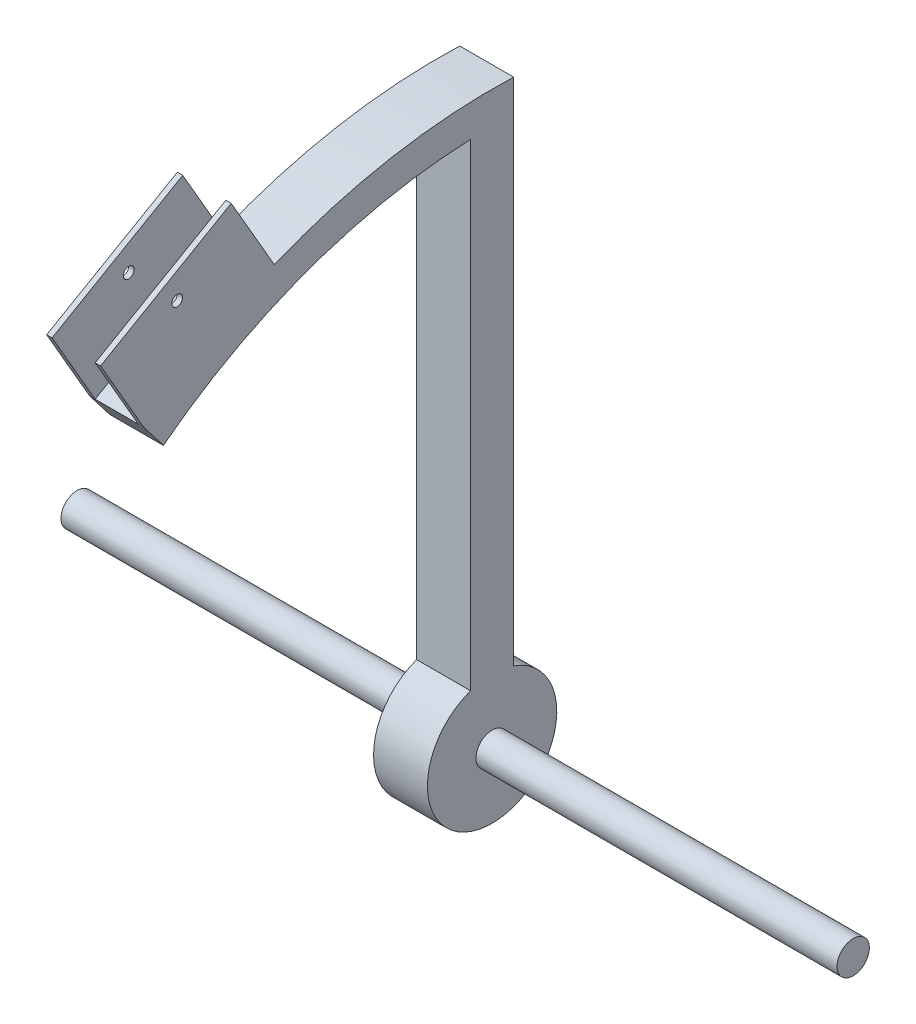
ISO-10303-21;
HEADER;
FILE_DESCRIPTION(('STEP AP214'),'2;1');
FILE_NAME('part.step','',(''),(''),'','','');
FILE_SCHEMA(('AUTOMOTIVE_DESIGN { 1 0 10303 214 1 1 1 1 }'));
ENDSEC;
DATA;
#1=APPLICATION_CONTEXT('core data for automotive mechanical design processes');
#2=APPLICATION_PROTOCOL_DEFINITION('international standard','automotive_design',2000,#1);
#3=PRODUCT_CONTEXT('',#1,'mechanical');
#4=PRODUCT('Part','Part','',(#3));
#5=PRODUCT_RELATED_PRODUCT_CATEGORY('part','',(#4));
#6=PRODUCT_DEFINITION_FORMATION('','',#4);
#7=PRODUCT_DEFINITION_CONTEXT('part definition',#1,'design');
#8=PRODUCT_DEFINITION('design','',#6,#7);
#9=PRODUCT_DEFINITION_SHAPE('','',#8);
#10=(LENGTH_UNIT() NAMED_UNIT(*) SI_UNIT(.MILLI.,.METRE.));
#11=(NAMED_UNIT(*) PLANE_ANGLE_UNIT() SI_UNIT($,.RADIAN.));
#12=(NAMED_UNIT(*) SI_UNIT($,.STERADIAN.) SOLID_ANGLE_UNIT());
#13=UNCERTAINTY_MEASURE_WITH_UNIT(LENGTH_MEASURE(1.E-05),#10,'distance_accuracy_value','');
#14=(GEOMETRIC_REPRESENTATION_CONTEXT(3) GLOBAL_UNCERTAINTY_ASSIGNED_CONTEXT((#13)) GLOBAL_UNIT_ASSIGNED_CONTEXT((#10,
#11,#12)) REPRESENTATION_CONTEXT('',''));
#15=CARTESIAN_POINT('',(0.,0.,0.));
#16=DIRECTION('',(0.,0.,1.));
#17=DIRECTION('',(1.,0.,0.));
#18=AXIS2_PLACEMENT_3D('',#15,#16,#17);
#19=CARTESIAN_POINT('',(-10.,222.266599697926,220.379977960167));
#20=DIRECTION('',(-1.,0.,0.));
#21=DIRECTION('',(0.,0.,1.));
#22=AXIS2_PLACEMENT_3D('',#19,#20,#21);
#23=PLANE('',#22);
#24=DIRECTION('',(0.,-0.866025403784435,-0.500000000000006));
#25=VECTOR('',#24,1.);
#26=CARTESIAN_POINT('',(-10.,244.627279472924,181.650144498093));
#27=LINE('',#26,#25);
#28=CARTESIAN_POINT('',(-10.,244.627279472924,181.650144498093));
#29=VERTEX_POINT('',#28);
#30=CARTESIAN_POINT('',(-10.,209.986263321546,161.650144498093));
#31=VERTEX_POINT('',#30);
#32=EDGE_CURVE('E206',#29,#31,#27,.T.);
#33=ORIENTED_EDGE('',*,*,#32,.T.);
#34=DIRECTION('',(0.,0.500000000000006,-0.866025403784435));
#35=VECTOR('',#34,1.);
#36=CARTESIAN_POINT('',(-10.,187.625583546548,200.379977960167));
#37=LINE('',#36,#35);
#38=CARTESIAN_POINT('',(-10.,244.986263321547,101.028366233182));
#39=VERTEX_POINT('',#38);
#40=EDGE_CURVE('E204',#31,#39,#37,.T.);
#41=ORIENTED_EDGE('',*,*,#40,.T.);
#42=DIRECTION('',(0.,0.866025403784435,0.500000000000006));
#43=VECTOR('',#42,1.);
#44=CARTESIAN_POINT('',(-10.,279.627279472924,121.028366233183));
#45=LINE('',#44,#43);
#46=CARTESIAN_POINT('',(-10.,279.627279472924,121.028366233183));
#47=VERTEX_POINT('',#46);
#48=EDGE_CURVE('E200',#39,#47,#45,.T.);
#49=ORIENTED_EDGE('',*,*,#48,.T.);
#50=DIRECTION('',(0.,0.500000000000006,-0.866025403784435));
#51=VECTOR('',#50,1.);
#52=CARTESIAN_POINT('',(-10.,222.266599697926,220.379977960167));
#53=LINE('',#52,#51);
#54=EDGE_CURVE('E216',#29,#47,#53,.T.);
#55=ORIENTED_EDGE('',*,*,#54,.F.);
#56=EDGE_LOOP('',(#33,#41,#49,#55));
#57=FACE_BOUND('',#56,.T.);
#58=CARTESIAN_POINT('',(-10.,253.077314003377,146.114255365638));
#59=DIRECTION('',(-1.,0.,0.));
#60=DIRECTION('',(0.,0.,1.));
#61=AXIS2_PLACEMENT_3D('',#58,#59,#60);
#62=CIRCLE('',#61,2.5);
#63=CARTESIAN_POINT('',(-10.,253.077314003377,148.614255365638));
#64=VERTEX_POINT('',#63);
#65=EDGE_CURVE('E191',#64,#64,#62,.T.);
#66=ORIENTED_EDGE('',*,*,#65,.T.);
#67=EDGE_LOOP('',(#66));
#68=FACE_BOUND('',#67,.T.);
#69=DIRECTION('',(0.,-0.500000000000006,0.866025403784435));
#70=VECTOR('',#69,1.);
#71=CARTESIAN_POINT('',(-10.,241.48145384993,122.098874308871));
#72=LINE('',#71,#70);
#73=CARTESIAN_POINT('',(-10.,241.48145384993,122.098874308871));
#74=VERTEX_POINT('',#73);
#75=CARTESIAN_POINT('',(-10.,226.48145384993,148.079636422404));
#76=VERTEX_POINT('',#75);
#77=EDGE_CURVE('E58',#74,#76,#72,.T.);
#78=ORIENTED_EDGE('',*,*,#77,.T.);
#79=DIRECTION('',(0.,0.866025403784438,0.500000000000001));
#80=VECTOR('',#79,1.);
#81=CARTESIAN_POINT('',(-10.,226.48145384993,148.079636422404));
#82=LINE('',#81,#80);
#83=CARTESIAN_POINT('',(-10.,230.811580868852,150.579636422404));
#84=VERTEX_POINT('',#83);
#85=EDGE_CURVE('E62',#76,#84,#82,.T.);
#86=ORIENTED_EDGE('',*,*,#85,.T.);
#87=DIRECTION('',(0.,0.500000000000006,-0.866025403784435));
#88=VECTOR('',#87,1.);
#89=CARTESIAN_POINT('',(-10.,245.811580868852,124.598874308871));
#90=LINE('',#89,#88);
#91=CARTESIAN_POINT('',(-10.,245.811580868852,124.598874308871));
#92=VERTEX_POINT('',#91);
#93=EDGE_CURVE('E157',#84,#92,#90,.T.);
#94=ORIENTED_EDGE('',*,*,#93,.T.);
#95=DIRECTION('',(0.,-0.866025403784437,-0.500000000000003));
#96=VECTOR('',#95,1.);
#97=CARTESIAN_POINT('',(-10.,241.48145384993,122.098874308871));
#98=LINE('',#97,#96);
#99=EDGE_CURVE('E160',#92,#74,#98,.T.);
#100=ORIENTED_EDGE('',*,*,#99,.T.);
#101=EDGE_LOOP('',(#78,#86,#94,#100));
#102=FACE_BOUND('',#101,.T.);
#103=ADVANCED_FACE('F41',(#57,#68,#102),#23,.F.);
#104=CARTESIAN_POINT('',(10.,222.266599697926,220.379977960167));
#105=DIRECTION('',(1.,0.,0.));
#106=DIRECTION('',(0.,0.,-1.));
#107=AXIS2_PLACEMENT_3D('',#104,#105,#106);
#108=PLANE('',#107);
#109=DIRECTION('',(0.,0.866025403784435,0.500000000000006));
#110=VECTOR('',#109,1.);
#111=CARTESIAN_POINT('',(10.,244.627279472924,181.650144498093));
#112=LINE('',#111,#110);
#113=CARTESIAN_POINT('',(10.,209.986263321546,161.650144498093));
#114=VERTEX_POINT('',#113);
#115=CARTESIAN_POINT('',(10.,244.627279472924,181.650144498093));
#116=VERTEX_POINT('',#115);
#117=EDGE_CURVE('E201',#114,#116,#112,.T.);
#118=ORIENTED_EDGE('',*,*,#117,.T.);
#119=DIRECTION('',(0.,0.500000000000006,-0.866025403784435));
#120=VECTOR('',#119,1.);
#121=CARTESIAN_POINT('',(10.,222.266599697926,220.379977960167));
#122=LINE('',#121,#120);
#123=CARTESIAN_POINT('',(10.,279.627279472924,121.028366233183));
#124=VERTEX_POINT('',#123);
#125=EDGE_CURVE('E220',#116,#124,#122,.T.);
#126=ORIENTED_EDGE('',*,*,#125,.T.);
#127=DIRECTION('',(0.,-0.866025403784435,-0.500000000000006));
#128=VECTOR('',#127,1.);
#129=CARTESIAN_POINT('',(10.,279.627279472924,121.028366233183));
#130=LINE('',#129,#128);
#131=CARTESIAN_POINT('',(10.,244.986263321547,101.028366233182));
#132=VERTEX_POINT('',#131);
#133=EDGE_CURVE('E210',#124,#132,#130,.T.);
#134=ORIENTED_EDGE('',*,*,#133,.T.);
#135=DIRECTION('',(0.,0.500000000000006,-0.866025403784435));
#136=VECTOR('',#135,1.);
#137=CARTESIAN_POINT('',(10.,187.625583546548,200.379977960167));
#138=LINE('',#137,#136);
#139=EDGE_CURVE('E218',#114,#132,#138,.T.);
#140=ORIENTED_EDGE('',*,*,#139,.F.);
#141=EDGE_LOOP('',(#118,#126,#134,#140));
#142=FACE_BOUND('',#141,.T.);
#143=CARTESIAN_POINT('',(10.,253.077314003377,146.114255365638));
#144=DIRECTION('',(1.,0.,0.));
#145=DIRECTION('',(0.,0.,-1.));
#146=AXIS2_PLACEMENT_3D('',#143,#144,#145);
#147=CIRCLE('',#146,2.5);
#148=CARTESIAN_POINT('',(10.,253.077314003377,143.614255365638));
#149=VERTEX_POINT('',#148);
#150=EDGE_CURVE('E45',#149,#149,#147,.T.);
#151=ORIENTED_EDGE('',*,*,#150,.T.);
#152=EDGE_LOOP('',(#151));
#153=FACE_BOUND('',#152,.T.);
#154=DIRECTION('',(0.,-0.500000000000006,0.866025403784435));
#155=VECTOR('',#154,1.);
#156=CARTESIAN_POINT('',(10.,241.48145384993,122.098874308871));
#157=LINE('',#156,#155);
#158=CARTESIAN_POINT('',(10.,241.48145384993,122.098874308871));
#159=VERTEX_POINT('',#158);
#160=CARTESIAN_POINT('',(10.,226.48145384993,148.079636422404));
#161=VERTEX_POINT('',#160);
#162=EDGE_CURVE('E187',#159,#161,#157,.T.);
#163=ORIENTED_EDGE('',*,*,#162,.F.);
#164=DIRECTION('',(0.,-0.866025403784437,-0.500000000000003));
#165=VECTOR('',#164,1.);
#166=CARTESIAN_POINT('',(10.,241.48145384993,122.098874308871));
#167=LINE('',#166,#165);
#168=CARTESIAN_POINT('',(10.,245.811580868852,124.598874308871));
#169=VERTEX_POINT('',#168);
#170=EDGE_CURVE('E173',#169,#159,#167,.T.);
#171=ORIENTED_EDGE('',*,*,#170,.F.);
#172=DIRECTION('',(0.,0.500000000000006,-0.866025403784435));
#173=VECTOR('',#172,1.);
#174=CARTESIAN_POINT('',(10.,245.811580868852,124.598874308871));
#175=LINE('',#174,#173);
#176=CARTESIAN_POINT('',(10.,230.811580868852,150.579636422404));
#177=VERTEX_POINT('',#176);
#178=EDGE_CURVE('E170',#177,#169,#175,.T.);
#179=ORIENTED_EDGE('',*,*,#178,.F.);
#180=DIRECTION('',(0.,0.866025403784438,0.500000000000001));
#181=VECTOR('',#180,1.);
#182=CARTESIAN_POINT('',(10.,226.48145384993,148.079636422404));
#183=LINE('',#182,#181);
#184=EDGE_CURVE('E186',#161,#177,#183,.T.);
#185=ORIENTED_EDGE('',*,*,#184,.F.);
#186=EDGE_LOOP('',(#163,#171,#179,#185));
#187=FACE_BOUND('',#186,.T.);
#188=ADVANCED_FACE('F323',(#142,#153,#187),#108,.F.);
#189=CARTESIAN_POINT('',(-12.5,244.627279472924,181.650144498093));
#190=DIRECTION('',(0.,0.500000000000006,-0.866025403784435));
#191=DIRECTION('',(0.,0.866025403784435,0.500000000000006));
#192=AXIS2_PLACEMENT_3D('',#189,#190,#191);
#193=PLANE('',#192);
#194=DIRECTION('',(-1.,0.,0.));
#195=VECTOR('',#194,1.);
#196=CARTESIAN_POINT('',(12.5,209.986263321546,161.650144498093));
#197=LINE('',#196,#195);
#198=CARTESIAN_POINT('',(-12.5,209.986263321546,161.650144498093));
#199=VERTEX_POINT('',#198);
#200=EDGE_CURVE('E291',#31,#199,#197,.T.);
#201=ORIENTED_EDGE('',*,*,#200,.F.);
#202=ORIENTED_EDGE('',*,*,#32,.F.);
#203=DIRECTION('',(1.,0.,0.));
#204=VECTOR('',#203,1.);
#205=CARTESIAN_POINT('',(-12.5,244.627279472924,181.650144498093));
#206=LINE('',#205,#204);
#207=CARTESIAN_POINT('',(-12.5,244.627279472924,181.650144498093));
#208=VERTEX_POINT('',#207);
#209=EDGE_CURVE('E227',#208,#29,#206,.T.);
#210=ORIENTED_EDGE('',*,*,#209,.F.);
#211=DIRECTION('',(0.,-0.866025403784435,-0.500000000000006));
#212=VECTOR('',#211,1.);
#213=CARTESIAN_POINT('',(-12.5,244.627279472924,181.650144498093));
#214=LINE('',#213,#212);
#215=EDGE_CURVE('E243',#208,#199,#214,.T.);
#216=ORIENTED_EDGE('',*,*,#215,.T.);
#217=EDGE_LOOP('',(#201,#202,#210,#216));
#218=FACE_BOUND('',#217,.T.);
#219=ADVANCED_FACE('F329',(#218),#193,.F.);
#220=CARTESIAN_POINT('',(-12.5,279.627279472924,121.028366233182));
#221=DIRECTION('',(0.,-0.500000000000006,0.866025403784435));
#222=DIRECTION('',(0.,-0.866025403784435,-0.500000000000006));
#223=AXIS2_PLACEMENT_3D('',#220,#221,#222);
#224=PLANE('',#223);
#225=DIRECTION('',(-1.,0.,0.));
#226=VECTOR('',#225,1.);
#227=CARTESIAN_POINT('',(-12.5,279.627279472924,121.028366233182));
#228=LINE('',#227,#226);
#229=CARTESIAN_POINT('',(-12.5,279.627279472924,121.028366233182));
#230=VERTEX_POINT('',#229);
#231=EDGE_CURVE('E232',#47,#230,#228,.T.);
#232=ORIENTED_EDGE('',*,*,#231,.F.);
#233=ORIENTED_EDGE('',*,*,#48,.F.);
#234=DIRECTION('',(-1.,0.,0.));
#235=VECTOR('',#234,1.);
#236=CARTESIAN_POINT('',(12.5,244.986263321547,101.028366233182));
#237=LINE('',#236,#235);
#238=CARTESIAN_POINT('',(-12.5,244.986263321547,101.028366233182));
#239=VERTEX_POINT('',#238);
#240=EDGE_CURVE('E295',#39,#239,#237,.T.);
#241=ORIENTED_EDGE('',*,*,#240,.T.);
#242=DIRECTION('',(0.,-0.866025403784435,-0.500000000000006));
#243=VECTOR('',#242,1.);
#244=CARTESIAN_POINT('',(-12.5,279.627279472924,121.028366233182));
#245=LINE('',#244,#243);
#246=EDGE_CURVE('E236',#230,#239,#245,.T.);
#247=ORIENTED_EDGE('',*,*,#246,.F.);
#248=EDGE_LOOP('',(#232,#233,#241,#247));
#249=FACE_BOUND('',#248,.T.);
#250=ADVANCED_FACE('F346',(#249),#224,.F.);
#251=CARTESIAN_POINT('',(0.,262.127279472923,151.339255365639));
#252=DIRECTION('',(0.,0.866025403784435,0.500000000000006));
#253=DIRECTION('',(0.,-0.500000000000006,0.866025403784435));
#254=AXIS2_PLACEMENT_3D('',#251,#252,#253);
#255=PLANE('',#254);
#256=ORIENTED_EDGE('',*,*,#54,.T.);
#257=ORIENTED_EDGE('',*,*,#231,.T.);
#258=DIRECTION('',(0.,-0.500000000000006,0.866025403784435));
#259=VECTOR('',#258,1.);
#260=CARTESIAN_POINT('',(-12.5,279.627279472924,121.028366233182));
#261=LINE('',#260,#259);
#262=EDGE_CURVE('E208',#230,#208,#261,.T.);
#263=ORIENTED_EDGE('',*,*,#262,.T.);
#264=ORIENTED_EDGE('',*,*,#209,.T.);
#265=EDGE_LOOP('',(#256,#257,#263,#264));
#266=FACE_BOUND('',#265,.T.);
#267=ADVANCED_FACE('F341',(#266),#255,.T.);
#268=CARTESIAN_POINT('',(12.5,0.,0.));
#269=DIRECTION('',(-1.,0.,0.));
#270=DIRECTION('',(0.,0.,1.));
#271=AXIS2_PLACEMENT_3D('',#268,#269,#270);
#272=CYLINDRICAL_SURFACE('',#271,30.);
#273=DIRECTION('',(-1.,0.,0.));
#274=VECTOR('',#273,1.);
#275=CARTESIAN_POINT('',(12.5,28.2842712474619,10.));
#276=LINE('',#275,#274);
#277=CARTESIAN_POINT('',(12.5,28.2842712474619,10.));
#278=VERTEX_POINT('',#277);
#279=CARTESIAN_POINT('',(-12.5,28.2842712474619,10.));
#280=VERTEX_POINT('',#279);
#281=EDGE_CURVE('E285',#278,#280,#276,.T.);
#282=ORIENTED_EDGE('',*,*,#281,.T.);
#283=CARTESIAN_POINT('',(-12.5,0.,0.));
#284=DIRECTION('',(1.,0.,0.));
#285=DIRECTION('',(0.,0.,-1.));
#286=AXIS2_PLACEMENT_3D('',#283,#284,#285);
#287=CIRCLE('',#286,30.);
#288=CARTESIAN_POINT('',(-12.5,28.2842712474619,-10.));
#289=VERTEX_POINT('',#288);
#290=EDGE_CURVE('E253',#280,#289,#287,.T.);
#291=ORIENTED_EDGE('',*,*,#290,.T.);
#292=DIRECTION('',(-1.,0.,0.));
#293=VECTOR('',#292,1.);
#294=CARTESIAN_POINT('',(12.5,28.2842712474619,-10.));
#295=LINE('',#294,#293);
#296=CARTESIAN_POINT('',(12.5,28.2842712474619,-10.));
#297=VERTEX_POINT('',#296);
#298=EDGE_CURVE('E50',#297,#289,#295,.T.);
#299=ORIENTED_EDGE('',*,*,#298,.F.);
#300=CARTESIAN_POINT('',(12.5,0.,0.));
#301=DIRECTION('',(1.,0.,0.));
#302=DIRECTION('',(0.,0.,-1.));
#303=AXIS2_PLACEMENT_3D('',#300,#301,#302);
#304=CIRCLE('',#303,30.);
#305=EDGE_CURVE('E271',#278,#297,#304,.T.);
#306=ORIENTED_EDGE('',*,*,#305,.F.);
#307=EDGE_LOOP('',(#282,#291,#299,#306));
#308=FACE_BOUND('',#307,.T.);
#309=ADVANCED_FACE('F43',(#308),#272,.T.);
#310=CARTESIAN_POINT('',(12.5,28.2842712474619,-10.));
#311=DIRECTION('',(0.,0.,1.));
#312=DIRECTION('',(0.,-1.,0.));
#313=AXIS2_PLACEMENT_3D('',#310,#311,#312);
#314=PLANE('',#313);
#315=ORIENTED_EDGE('',*,*,#298,.T.);
#316=DIRECTION('',(0.,1.,0.));
#317=VECTOR('',#316,1.);
#318=CARTESIAN_POINT('',(-12.5,28.2842712474619,-10.));
#319=LINE('',#318,#317);
#320=CARTESIAN_POINT('',(-12.5,264.811253537308,-10.));
#321=VERTEX_POINT('',#320);
#322=EDGE_CURVE('E256',#289,#321,#319,.T.);
#323=ORIENTED_EDGE('',*,*,#322,.T.);
#324=DIRECTION('',(-1.,0.,0.));
#325=VECTOR('',#324,1.);
#326=CARTESIAN_POINT('',(12.5,264.811253537308,-10.));
#327=LINE('',#326,#325);
#328=CARTESIAN_POINT('',(12.5,264.811253537308,-10.));
#329=VERTEX_POINT('',#328);
#330=EDGE_CURVE('E299',#329,#321,#327,.T.);
#331=ORIENTED_EDGE('',*,*,#330,.F.);
#332=DIRECTION('',(0.,1.,0.));
#333=VECTOR('',#332,1.);
#334=CARTESIAN_POINT('',(12.5,28.2842712474619,-10.));
#335=LINE('',#334,#333);
#336=EDGE_CURVE('E274',#297,#329,#335,.T.);
#337=ORIENTED_EDGE('',*,*,#336,.F.);
#338=EDGE_LOOP('',(#315,#323,#331,#337));
#339=FACE_BOUND('',#338,.T.);
#340=ADVANCED_FACE('F571',(#339),#314,.F.);
#341=CARTESIAN_POINT('',(12.5,0.,0.));
#342=DIRECTION('',(-1.,0.,0.));
#343=DIRECTION('',(0.,0.,1.));
#344=AXIS2_PLACEMENT_3D('',#341,#342,#343);
#345=CYLINDRICAL_SURFACE('',#344,265.);
#346=ORIENTED_EDGE('',*,*,#330,.T.);
#347=CARTESIAN_POINT('',(-12.5,0.,0.));
#348=DIRECTION('',(1.,0.,0.));
#349=DIRECTION('',(0.,0.,-1.));
#350=AXIS2_PLACEMENT_3D('',#347,#348,#349);
#351=CIRCLE('',#350,265.);
#352=EDGE_CURVE('E259',#321,#239,#351,.T.);
#353=ORIENTED_EDGE('',*,*,#352,.T.);
#354=ORIENTED_EDGE('',*,*,#240,.F.);
#355=DIRECTION('',(-1.,0.,0.));
#356=VECTOR('',#355,1.);
#357=CARTESIAN_POINT('',(10.,244.986263321547,101.028366233182));
#358=LINE('',#357,#356);
#359=EDGE_CURVE('E213',#132,#39,#358,.T.);
#360=ORIENTED_EDGE('',*,*,#359,.F.);
#361=CARTESIAN_POINT('',(12.5,244.986263321547,101.028366233182));
#362=VERTEX_POINT('',#361);
#363=EDGE_CURVE('E296',#362,#132,#237,.T.);
#364=ORIENTED_EDGE('',*,*,#363,.F.);
#365=CARTESIAN_POINT('',(12.5,0.,0.));
#366=DIRECTION('',(1.,0.,0.));
#367=DIRECTION('',(0.,0.,-1.));
#368=AXIS2_PLACEMENT_3D('',#365,#366,#367);
#369=CIRCLE('',#368,265.);
#370=EDGE_CURVE('E276',#329,#362,#369,.T.);
#371=ORIENTED_EDGE('',*,*,#370,.F.);
#372=EDGE_LOOP('',(#346,#353,#354,#360,#364,#371));
#373=FACE_BOUND('',#372,.T.);
#374=ADVANCED_FACE('F576',(#373),#345,.T.);
#375=CARTESIAN_POINT('',(12.5,209.986263321546,161.650144498093));
#376=DIRECTION('',(0.,0.610000545275824,-0.79240099366621));
#377=DIRECTION('',(0.,0.79240099366621,0.610000545275824));
#378=AXIS2_PLACEMENT_3D('',#375,#376,#377);
#379=PLANE('',#378);
#380=CARTESIAN_POINT('',(12.5,209.986263321546,161.650144498093));
#381=VERTEX_POINT('',#380);
#382=EDGE_CURVE('E292',#381,#114,#197,.T.);
#383=ORIENTED_EDGE('',*,*,#382,.T.);
#384=DIRECTION('',(1.,0.,0.));
#385=VECTOR('',#384,1.);
#386=CARTESIAN_POINT('',(10.,209.986263321546,161.650144498093));
#387=LINE('',#386,#385);
#388=EDGE_CURVE('E203',#31,#114,#387,.T.);
#389=ORIENTED_EDGE('',*,*,#388,.F.);
#390=ORIENTED_EDGE('',*,*,#200,.T.);
#391=DIRECTION('',(0.,-0.79240099366621,-0.610000545275824));
#392=VECTOR('',#391,1.);
#393=CARTESIAN_POINT('',(-12.5,209.986263321546,161.650144498093));
#394=LINE('',#393,#392);
#395=CARTESIAN_POINT('',(-12.5,198.100248416553,152.500136318955));
#396=VERTEX_POINT('',#395);
#397=EDGE_CURVE('E262',#199,#396,#394,.T.);
#398=ORIENTED_EDGE('',*,*,#397,.T.);
#399=DIRECTION('',(-1.,0.,0.));
#400=VECTOR('',#399,1.);
#401=CARTESIAN_POINT('',(12.5,198.100248416553,152.500136318955));
#402=LINE('',#401,#400);
#403=CARTESIAN_POINT('',(12.5,198.100248416553,152.500136318955));
#404=VERTEX_POINT('',#403);
#405=EDGE_CURVE('E289',#404,#396,#402,.T.);
#406=ORIENTED_EDGE('',*,*,#405,.F.);
#407=DIRECTION('',(0.,-0.79240099366621,-0.610000545275824));
#408=VECTOR('',#407,1.);
#409=CARTESIAN_POINT('',(12.5,209.986263321546,161.650144498093));
#410=LINE('',#409,#408);
#411=EDGE_CURVE('E279',#381,#404,#410,.T.);
#412=ORIENTED_EDGE('',*,*,#411,.F.);
#413=EDGE_LOOP('',(#383,#389,#390,#398,#406,#412));
#414=FACE_BOUND('',#413,.T.);
#415=ADVANCED_FACE('F562',(#414),#379,.F.);
#416=CARTESIAN_POINT('',(12.5,0.,0.));
#417=DIRECTION('',(-1.,0.,0.));
#418=DIRECTION('',(0.,0.,1.));
#419=AXIS2_PLACEMENT_3D('',#416,#417,#418);
#420=CYLINDRICAL_SURFACE('',#419,250.);
#421=ORIENTED_EDGE('',*,*,#405,.T.);
#422=CARTESIAN_POINT('',(-12.5,0.,0.));
#423=DIRECTION('',(-1.,0.,0.));
#424=DIRECTION('',(0.,0.,-1.));
#425=AXIS2_PLACEMENT_3D('',#422,#423,#424);
#426=CIRCLE('',#425,250.);
#427=CARTESIAN_POINT('',(-12.5,249.799919935936,10.));
#428=VERTEX_POINT('',#427);
#429=EDGE_CURVE('E265',#396,#428,#426,.T.);
#430=ORIENTED_EDGE('',*,*,#429,.T.);
#431=DIRECTION('',(-1.,0.,0.));
#432=VECTOR('',#431,1.);
#433=CARTESIAN_POINT('',(12.5,249.799919935936,10.));
#434=LINE('',#433,#432);
#435=CARTESIAN_POINT('',(12.5,249.799919935936,10.));
#436=VERTEX_POINT('',#435);
#437=EDGE_CURVE('E287',#436,#428,#434,.T.);
#438=ORIENTED_EDGE('',*,*,#437,.F.);
#439=CARTESIAN_POINT('',(12.5,0.,0.));
#440=DIRECTION('',(-1.,0.,0.));
#441=DIRECTION('',(0.,0.,-1.));
#442=AXIS2_PLACEMENT_3D('',#439,#440,#441);
#443=CIRCLE('',#442,250.);
#444=EDGE_CURVE('E281',#404,#436,#443,.T.);
#445=ORIENTED_EDGE('',*,*,#444,.F.);
#446=EDGE_LOOP('',(#421,#430,#438,#445));
#447=FACE_BOUND('',#446,.T.);
#448=ADVANCED_FACE('F551',(#447),#420,.F.);
#449=CARTESIAN_POINT('',(12.5,28.2842712474619,10.));
#450=DIRECTION('',(0.,0.,-1.));
#451=DIRECTION('',(-1.,0.,0.));
#452=AXIS2_PLACEMENT_3D('',#449,#450,#451);
#453=PLANE('',#452);
#454=ORIENTED_EDGE('',*,*,#437,.T.);
#455=DIRECTION('',(0.,-1.,0.));
#456=VECTOR('',#455,1.);
#457=CARTESIAN_POINT('',(-12.5,28.2842712474619,10.));
#458=LINE('',#457,#456);
#459=EDGE_CURVE('E268',#428,#280,#458,.T.);
#460=ORIENTED_EDGE('',*,*,#459,.T.);
#461=ORIENTED_EDGE('',*,*,#281,.F.);
#462=DIRECTION('',(0.,-1.,0.));
#463=VECTOR('',#462,1.);
#464=CARTESIAN_POINT('',(12.5,28.2842712474619,10.));
#465=LINE('',#464,#463);
#466=EDGE_CURVE('E283',#436,#278,#465,.T.);
#467=ORIENTED_EDGE('',*,*,#466,.F.);
#468=EDGE_LOOP('',(#454,#460,#461,#467));
#469=FACE_BOUND('',#468,.T.);
#470=ADVANCED_FACE('F517',(#469),#453,.F.);
#471=CARTESIAN_POINT('',(12.5,0.,0.));
#472=DIRECTION('',(1.,0.,0.));
#473=DIRECTION('',(0.,0.,-1.));
#474=AXIS2_PLACEMENT_3D('',#471,#472,#473);
#475=PLANE('',#474);
#476=CARTESIAN_POINT('',(12.5,253.077314003377,146.114255365638));
#477=DIRECTION('',(1.,0.,0.));
#478=DIRECTION('',(0.,0.,-1.));
#479=AXIS2_PLACEMENT_3D('',#476,#477,#478);
#480=CIRCLE('',#479,2.5);
#481=CARTESIAN_POINT('',(12.5,253.077314003377,143.614255365638));
#482=VERTEX_POINT('',#481);
#483=EDGE_CURVE('E197',#482,#482,#480,.T.);
#484=ORIENTED_EDGE('',*,*,#483,.F.);
#485=EDGE_LOOP('',(#484));
#486=FACE_BOUND('',#485,.T.);
#487=CARTESIAN_POINT('',(12.5,0.,0.));
#488=DIRECTION('',(1.,0.,0.));
#489=DIRECTION('',(0.,0.,-1.));
#490=AXIS2_PLACEMENT_3D('',#487,#488,#489);
#491=CIRCLE('',#490,7.5);
#492=CARTESIAN_POINT('',(12.5,0.,-7.5));
#493=VERTEX_POINT('',#492);
#494=EDGE_CURVE('E11',#493,#493,#491,.T.);
#495=ORIENTED_EDGE('',*,*,#494,.F.);
#496=EDGE_LOOP('',(#495));
#497=FACE_BOUND('',#496,.T.);
#498=ORIENTED_EDGE('',*,*,#305,.T.);
#499=ORIENTED_EDGE('',*,*,#336,.T.);
#500=ORIENTED_EDGE('',*,*,#370,.T.);
#501=DIRECTION('',(0.,-0.866025403784435,-0.500000000000006));
#502=VECTOR('',#501,1.);
#503=CARTESIAN_POINT('',(12.5,279.627279472924,121.028366233182));
#504=LINE('',#503,#502);
#505=CARTESIAN_POINT('',(12.5,279.627279472924,121.028366233182));
#506=VERTEX_POINT('',#505);
#507=EDGE_CURVE('E239',#506,#362,#504,.T.);
#508=ORIENTED_EDGE('',*,*,#507,.F.);
#509=DIRECTION('',(0.,0.500000000000006,-0.866025403784435));
#510=VECTOR('',#509,1.);
#511=CARTESIAN_POINT('',(12.5,279.627279472924,121.028366233182));
#512=LINE('',#511,#510);
#513=CARTESIAN_POINT('',(12.5,244.627279472924,181.650144498093));
#514=VERTEX_POINT('',#513);
#515=EDGE_CURVE('E230',#514,#506,#512,.T.);
#516=ORIENTED_EDGE('',*,*,#515,.F.);
#517=DIRECTION('',(0.,-0.866025403784435,-0.500000000000006));
#518=VECTOR('',#517,1.);
#519=CARTESIAN_POINT('',(12.5,244.627279472924,181.650144498093));
#520=LINE('',#519,#518);
#521=EDGE_CURVE('E241',#514,#381,#520,.T.);
#522=ORIENTED_EDGE('',*,*,#521,.T.);
#523=ORIENTED_EDGE('',*,*,#411,.T.);
#524=ORIENTED_EDGE('',*,*,#444,.T.);
#525=ORIENTED_EDGE('',*,*,#466,.T.);
#526=EDGE_LOOP('',(#498,#499,#500,#508,#516,#522,#523,#524,#525));
#527=FACE_BOUND('',#526,.T.);
#528=ADVANCED_FACE('F506',(#486,#497,#527),#475,.T.);
#529=CARTESIAN_POINT('',(-12.5,0.,0.));
#530=DIRECTION('',(1.,0.,0.));
#531=DIRECTION('',(0.,0.,-1.));
#532=AXIS2_PLACEMENT_3D('',#529,#530,#531);
#533=PLANE('',#532);
#534=CARTESIAN_POINT('',(-12.5,253.077314003377,146.114255365638));
#535=DIRECTION('',(1.,0.,0.));
#536=DIRECTION('',(0.,0.,-1.));
#537=AXIS2_PLACEMENT_3D('',#534,#535,#536);
#538=CIRCLE('',#537,2.5);
#539=CARTESIAN_POINT('',(-12.5,253.077314003377,143.614255365638));
#540=VERTEX_POINT('',#539);
#541=EDGE_CURVE('E194',#540,#540,#538,.T.);
#542=ORIENTED_EDGE('',*,*,#541,.T.);
#543=EDGE_LOOP('',(#542));
#544=FACE_BOUND('',#543,.T.);
#545=CARTESIAN_POINT('',(-12.5,0.,0.));
#546=DIRECTION('',(1.,0.,0.));
#547=DIRECTION('',(0.,0.,-1.));
#548=AXIS2_PLACEMENT_3D('',#545,#546,#547);
#549=CIRCLE('',#548,7.5);
#550=CARTESIAN_POINT('',(-12.5,0.,-7.5));
#551=VERTEX_POINT('',#550);
#552=EDGE_CURVE('E251',#551,#551,#549,.T.);
#553=ORIENTED_EDGE('',*,*,#552,.T.);
#554=EDGE_LOOP('',(#553));
#555=FACE_BOUND('',#554,.T.);
#556=ORIENTED_EDGE('',*,*,#290,.F.);
#557=ORIENTED_EDGE('',*,*,#459,.F.);
#558=ORIENTED_EDGE('',*,*,#429,.F.);
#559=ORIENTED_EDGE('',*,*,#397,.F.);
#560=ORIENTED_EDGE('',*,*,#215,.F.);
#561=ORIENTED_EDGE('',*,*,#262,.F.);
#562=ORIENTED_EDGE('',*,*,#246,.T.);
#563=ORIENTED_EDGE('',*,*,#352,.F.);
#564=ORIENTED_EDGE('',*,*,#322,.F.);
#565=EDGE_LOOP('',(#556,#557,#558,#559,#560,#561,#562,#563,#564));
#566=FACE_BOUND('',#565,.T.);
#567=ADVANCED_FACE('F304',(#544,#555,#566),#533,.F.);
#568=CARTESIAN_POINT('',(-180.,0.,0.));
#569=DIRECTION('',(1.,0.,0.));
#570=DIRECTION('',(0.,0.,-1.));
#571=AXIS2_PLACEMENT_3D('',#568,#569,#570);
#572=PLANE('',#571);
#573=CARTESIAN_POINT('',(-180.,0.,0.));
#574=DIRECTION('',(1.,0.,0.));
#575=DIRECTION('',(0.,0.,-1.));
#576=AXIS2_PLACEMENT_3D('',#573,#574,#575);
#577=CIRCLE('',#576,7.5);
#578=CARTESIAN_POINT('',(-180.,0.,-7.5));
#579=VERTEX_POINT('',#578);
#580=EDGE_CURVE('E249',#579,#579,#577,.T.);
#581=ORIENTED_EDGE('',*,*,#580,.F.);
#582=EDGE_LOOP('',(#581));
#583=FACE_BOUND('',#582,.T.);
#584=ADVANCED_FACE('F310',(#583),#572,.F.);
#585=CARTESIAN_POINT('',(-180.,0.,0.));
#586=DIRECTION('',(1.,0.,0.));
#587=DIRECTION('',(0.,0.,-1.));
#588=AXIS2_PLACEMENT_3D('',#585,#586,#587);
#589=CYLINDRICAL_SURFACE('',#588,7.5);
#590=ORIENTED_EDGE('',*,*,#580,.T.);
#591=EDGE_LOOP('',(#590));
#592=FACE_BOUND('',#591,.T.);
#593=ORIENTED_EDGE('',*,*,#552,.F.);
#594=EDGE_LOOP('',(#593));
#595=FACE_BOUND('',#594,.T.);
#596=ADVANCED_FACE('F307',(#592,#595),#589,.T.);
#597=ORIENTED_EDGE('',*,*,#494,.T.);
#598=EDGE_LOOP('',(#597));
#599=FACE_BOUND('',#598,.T.);
#600=CARTESIAN_POINT('',(180.,0.,0.));
#601=DIRECTION('',(1.,0.,0.));
#602=DIRECTION('',(0.,0.,-1.));
#603=AXIS2_PLACEMENT_3D('',#600,#601,#602);
#604=CIRCLE('',#603,7.5);
#605=CARTESIAN_POINT('',(180.,0.,-7.5));
#606=VERTEX_POINT('',#605);
#607=EDGE_CURVE('E246',#606,#606,#604,.T.);
#608=ORIENTED_EDGE('',*,*,#607,.F.);
#609=EDGE_LOOP('',(#608));
#610=FACE_BOUND('',#609,.T.);
#611=ADVANCED_FACE('F309',(#599,#610),#589,.T.);
#612=CARTESIAN_POINT('',(180.,0.,0.));
#613=DIRECTION('',(1.,0.,0.));
#614=DIRECTION('',(0.,0.,-1.));
#615=AXIS2_PLACEMENT_3D('',#612,#613,#614);
#616=PLANE('',#615);
#617=ORIENTED_EDGE('',*,*,#607,.T.);
#618=EDGE_LOOP('',(#617));
#619=FACE_BOUND('',#618,.T.);
#620=ADVANCED_FACE('F317',(#619),#616,.T.);
#621=EDGE_CURVE('E226',#116,#514,#206,.T.);
#622=ORIENTED_EDGE('',*,*,#621,.F.);
#623=ORIENTED_EDGE('',*,*,#117,.F.);
#624=ORIENTED_EDGE('',*,*,#382,.F.);
#625=ORIENTED_EDGE('',*,*,#521,.F.);
#626=EDGE_LOOP('',(#622,#623,#624,#625));
#627=FACE_BOUND('',#626,.T.);
#628=ADVANCED_FACE('F344',(#627),#193,.F.);
#629=ORIENTED_EDGE('',*,*,#363,.T.);
#630=ORIENTED_EDGE('',*,*,#133,.F.);
#631=EDGE_CURVE('E233',#506,#124,#228,.T.);
#632=ORIENTED_EDGE('',*,*,#631,.F.);
#633=ORIENTED_EDGE('',*,*,#507,.T.);
#634=EDGE_LOOP('',(#629,#630,#632,#633));
#635=FACE_BOUND('',#634,.T.);
#636=ADVANCED_FACE('F339',(#635),#224,.F.);
#637=ORIENTED_EDGE('',*,*,#125,.F.);
#638=ORIENTED_EDGE('',*,*,#621,.T.);
#639=ORIENTED_EDGE('',*,*,#515,.T.);
#640=ORIENTED_EDGE('',*,*,#631,.T.);
#641=EDGE_LOOP('',(#637,#638,#639,#640));
#642=FACE_BOUND('',#641,.T.);
#643=ADVANCED_FACE('F335',(#642),#255,.T.);
#644=CARTESIAN_POINT('',(10.,187.625583546548,200.379977960167));
#645=DIRECTION('',(0.,-0.866025403784435,-0.500000000000006));
#646=DIRECTION('',(0.,0.500000000000006,-0.866025403784435));
#647=AXIS2_PLACEMENT_3D('',#644,#645,#646);
#648=PLANE('',#647);
#649=ORIENTED_EDGE('',*,*,#388,.T.);
#650=ORIENTED_EDGE('',*,*,#139,.T.);
#651=ORIENTED_EDGE('',*,*,#359,.T.);
#652=ORIENTED_EDGE('',*,*,#40,.F.);
#653=EDGE_LOOP('',(#649,#650,#651,#652));
#654=FACE_BOUND('',#653,.T.);
#655=ADVANCED_FACE('F338',(#654),#648,.F.);
#656=CARTESIAN_POINT('',(180.,253.077314003377,146.114255365638));
#657=DIRECTION('',(-1.,0.,0.));
#658=DIRECTION('',(0.,0.,1.));
#659=AXIS2_PLACEMENT_3D('',#656,#657,#658);
#660=CYLINDRICAL_SURFACE('',#659,2.5);
#661=ORIENTED_EDGE('',*,*,#483,.T.);
#662=EDGE_LOOP('',(#661));
#663=FACE_BOUND('',#662,.T.);
#664=ORIENTED_EDGE('',*,*,#150,.F.);
#665=EDGE_LOOP('',(#664));
#666=FACE_BOUND('',#665,.T.);
#667=ADVANCED_FACE('F378',(#663,#666),#660,.F.);
#668=ORIENTED_EDGE('',*,*,#65,.F.);
#669=EDGE_LOOP('',(#668));
#670=FACE_BOUND('',#669,.T.);
#671=ORIENTED_EDGE('',*,*,#541,.F.);
#672=EDGE_LOOP('',(#671));
#673=FACE_BOUND('',#672,.T.);
#674=ADVANCED_FACE('F386',(#670,#673),#660,.F.);
#675=CARTESIAN_POINT('',(-44.4210345738668,241.48145384993,122.098874308871));
#676=DIRECTION('',(0.,0.866025403784435,0.500000000000006));
#677=DIRECTION('',(0.,-0.500000000000006,0.866025403784435));
#678=AXIS2_PLACEMENT_3D('',#675,#676,#677);
#679=PLANE('',#678);
#680=ORIENTED_EDGE('',*,*,#77,.F.);
#681=DIRECTION('',(1.,0.,0.));
#682=VECTOR('',#681,1.);
#683=CARTESIAN_POINT('',(-44.4210345738668,241.48145384993,122.098874308871));
#684=LINE('',#683,#682);
#685=EDGE_CURVE('E177',#74,#159,#684,.T.);
#686=ORIENTED_EDGE('',*,*,#685,.T.);
#687=ORIENTED_EDGE('',*,*,#162,.T.);
#688=DIRECTION('',(1.,0.,0.));
#689=VECTOR('',#688,1.);
#690=CARTESIAN_POINT('',(-44.4210345738668,226.48145384993,148.079636422404));
#691=LINE('',#690,#689);
#692=EDGE_CURVE('E183',#76,#161,#691,.T.);
#693=ORIENTED_EDGE('',*,*,#692,.F.);
#694=EDGE_LOOP('',(#680,#686,#687,#693));
#695=FACE_BOUND('',#694,.T.);
#696=ADVANCED_FACE('F395',(#695),#679,.F.);
#697=CARTESIAN_POINT('',(-44.4210345738668,226.48145384993,148.079636422404));
#698=DIRECTION('',(0.,0.500000000000001,-0.866025403784438));
#699=DIRECTION('',(0.,0.866025403784438,0.500000000000001));
#700=AXIS2_PLACEMENT_3D('',#697,#698,#699);
#701=PLANE('',#700);
#702=ORIENTED_EDGE('',*,*,#85,.F.);
#703=ORIENTED_EDGE('',*,*,#692,.T.);
#704=ORIENTED_EDGE('',*,*,#184,.T.);
#705=DIRECTION('',(1.,0.,0.));
#706=VECTOR('',#705,1.);
#707=CARTESIAN_POINT('',(-44.4210345738668,230.811580868852,150.579636422404));
#708=LINE('',#707,#706);
#709=EDGE_CURVE('E188',#84,#177,#708,.T.);
#710=ORIENTED_EDGE('',*,*,#709,.F.);
#711=EDGE_LOOP('',(#702,#703,#704,#710));
#712=FACE_BOUND('',#711,.T.);
#713=ADVANCED_FACE('F402',(#712),#701,.F.);
#714=CARTESIAN_POINT('',(-44.4210345738668,245.811580868852,124.598874308871));
#715=DIRECTION('',(0.,-0.866025403784435,-0.500000000000006));
#716=DIRECTION('',(0.,0.500000000000006,-0.866025403784435));
#717=AXIS2_PLACEMENT_3D('',#714,#715,#716);
#718=PLANE('',#717);
#719=ORIENTED_EDGE('',*,*,#93,.F.);
#720=ORIENTED_EDGE('',*,*,#709,.T.);
#721=ORIENTED_EDGE('',*,*,#178,.T.);
#722=DIRECTION('',(1.,0.,0.));
#723=VECTOR('',#722,1.);
#724=CARTESIAN_POINT('',(-44.4210345738668,245.811580868852,124.598874308871));
#725=LINE('',#724,#723);
#726=EDGE_CURVE('E168',#92,#169,#725,.T.);
#727=ORIENTED_EDGE('',*,*,#726,.F.);
#728=EDGE_LOOP('',(#719,#720,#721,#727));
#729=FACE_BOUND('',#728,.T.);
#730=ADVANCED_FACE('F169',(#729),#718,.F.);
#731=CARTESIAN_POINT('',(-44.4210345738668,241.48145384993,122.098874308871));
#732=DIRECTION('',(0.,-0.500000000000003,0.866025403784437));
#733=DIRECTION('',(0.,-0.866025403784437,-0.500000000000003));
#734=AXIS2_PLACEMENT_3D('',#731,#732,#733);
#735=PLANE('',#734);
#736=ORIENTED_EDGE('',*,*,#99,.F.);
#737=ORIENTED_EDGE('',*,*,#726,.T.);
#738=ORIENTED_EDGE('',*,*,#170,.T.);
#739=ORIENTED_EDGE('',*,*,#685,.F.);
#740=EDGE_LOOP('',(#736,#737,#738,#739));
#741=FACE_BOUND('',#740,.T.);
#742=ADVANCED_FACE('F175',(#741),#735,.F.);
#743=CLOSED_SHELL('',(#103,#188,#219,#250,#267,#309,#340,#374,#415,#448,#470,#528,#567,#584,
#596,#611,#620,#628,#636,#643,#655,#667,#674,#696,#713,#730,#742));
#744=MANIFOLD_SOLID_BREP('B2',#743);
#745=ADVANCED_BREP_SHAPE_REPRESENTATION('',(#18,#744),#14);
#746=SHAPE_DEFINITION_REPRESENTATION(#9,#745);
ENDSEC;
END-ISO-10303-21;
